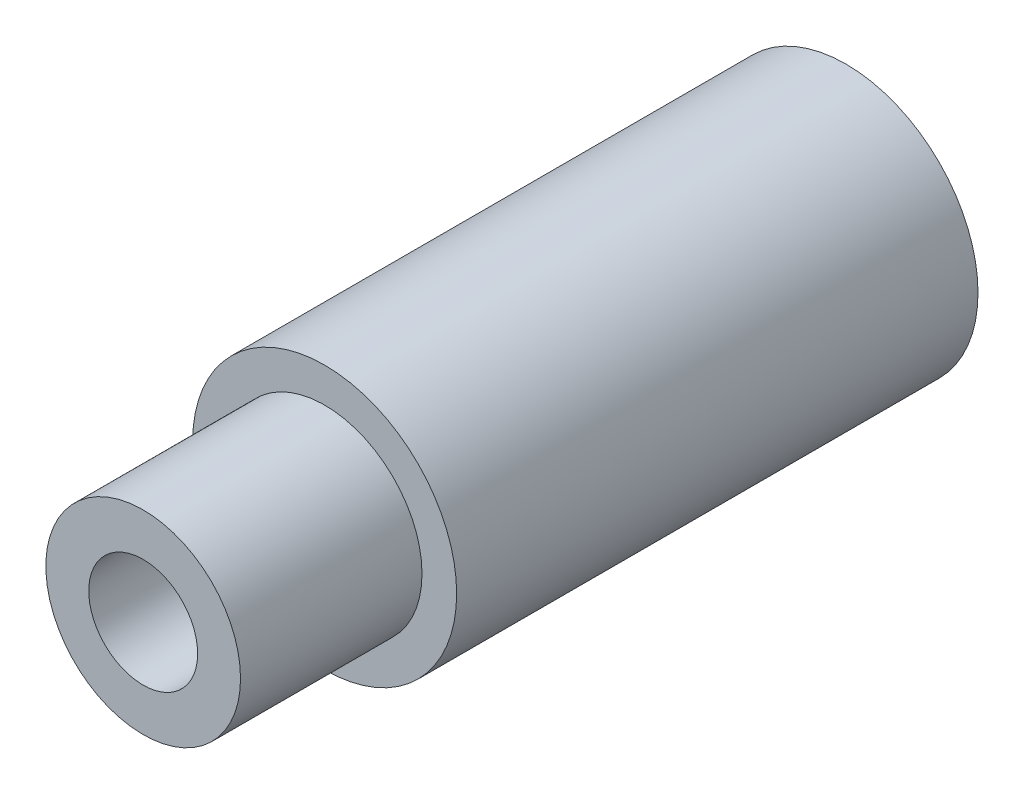
ISO-10303-21;
HEADER;
FILE_DESCRIPTION(('STEP AP214'),'2;1');
FILE_NAME('part.step','',(''),(''),'','','');
FILE_SCHEMA(('AUTOMOTIVE_DESIGN { 1 0 10303 214 1 1 1 1 }'));
ENDSEC;
DATA;
#1=APPLICATION_CONTEXT('core data for automotive mechanical design processes');
#2=APPLICATION_PROTOCOL_DEFINITION('international standard','automotive_design',2000,#1);
#3=PRODUCT_CONTEXT('',#1,'mechanical');
#4=PRODUCT('Part','Part','',(#3));
#5=PRODUCT_RELATED_PRODUCT_CATEGORY('part','',(#4));
#6=PRODUCT_DEFINITION_FORMATION('','',#4);
#7=PRODUCT_DEFINITION_CONTEXT('part definition',#1,'design');
#8=PRODUCT_DEFINITION('design','',#6,#7);
#9=PRODUCT_DEFINITION_SHAPE('','',#8);
#10=(LENGTH_UNIT() NAMED_UNIT(*) SI_UNIT(.MILLI.,.METRE.));
#11=(NAMED_UNIT(*) PLANE_ANGLE_UNIT() SI_UNIT($,.RADIAN.));
#12=(NAMED_UNIT(*) SI_UNIT($,.STERADIAN.) SOLID_ANGLE_UNIT());
#13=UNCERTAINTY_MEASURE_WITH_UNIT(LENGTH_MEASURE(1.E-05),#10,'distance_accuracy_value','');
#14=(GEOMETRIC_REPRESENTATION_CONTEXT(3) GLOBAL_UNCERTAINTY_ASSIGNED_CONTEXT((#13)) GLOBAL_UNIT_ASSIGNED_CONTEXT((#10,
#11,#12)) REPRESENTATION_CONTEXT('',''));
#15=CARTESIAN_POINT('',(0.,0.,0.));
#16=DIRECTION('',(0.,0.,1.));
#17=DIRECTION('',(1.,0.,0.));
#18=AXIS2_PLACEMENT_3D('',#15,#16,#17);
#19=CARTESIAN_POINT('',(0.,0.,7.9));
#20=DIRECTION('',(0.,0.,-1.));
#21=DIRECTION('',(-1.,0.,0.));
#22=AXIS2_PLACEMENT_3D('',#19,#20,#21);
#23=CYLINDRICAL_SURFACE('',#22,4.);
#24=CARTESIAN_POINT('',(0.,0.,7.9));
#25=DIRECTION('',(0.,0.,1.));
#26=DIRECTION('',(1.,0.,0.));
#27=AXIS2_PLACEMENT_3D('',#24,#25,#26);
#28=CIRCLE('',#27,4.);
#29=CARTESIAN_POINT('',(4.,0.,7.9));
#30=VERTEX_POINT('',#29);
#31=EDGE_CURVE('E45',#30,#30,#28,.T.);
#32=ORIENTED_EDGE('',*,*,#31,.F.);
#33=EDGE_LOOP('',(#32));
#34=FACE_BOUND('',#33,.T.);
#35=CARTESIAN_POINT('',(0.,0.,-7.9));
#36=DIRECTION('',(0.,0.,1.));
#37=DIRECTION('',(1.,0.,0.));
#38=AXIS2_PLACEMENT_3D('',#35,#36,#37);
#39=CIRCLE('',#38,4.);
#40=CARTESIAN_POINT('',(4.,0.,-7.9));
#41=VERTEX_POINT('',#40);
#42=EDGE_CURVE('E40',#41,#41,#39,.T.);
#43=ORIENTED_EDGE('',*,*,#42,.T.);
#44=EDGE_LOOP('',(#43));
#45=FACE_BOUND('',#44,.T.);
#46=ADVANCED_FACE('F37',(#34,#45),#23,.T.);
#47=CARTESIAN_POINT('',(0.,0.,7.9));
#48=DIRECTION('',(0.,0.,1.));
#49=DIRECTION('',(1.,0.,0.));
#50=AXIS2_PLACEMENT_3D('',#47,#48,#49);
#51=PLANE('',#50);
#52=CARTESIAN_POINT('',(0.,0.,7.9));
#53=DIRECTION('',(0.,0.,1.));
#54=DIRECTION('',(1.,0.,0.));
#55=AXIS2_PLACEMENT_3D('',#52,#53,#54);
#56=CIRCLE('',#55,2.95);
#57=CARTESIAN_POINT('',(2.95,0.,7.9));
#58=VERTEX_POINT('',#57);
#59=EDGE_CURVE('E11',#58,#58,#56,.T.);
#60=ORIENTED_EDGE('',*,*,#59,.F.);
#61=EDGE_LOOP('',(#60));
#62=FACE_BOUND('',#61,.T.);
#63=ORIENTED_EDGE('',*,*,#31,.T.);
#64=EDGE_LOOP('',(#63));
#65=FACE_BOUND('',#64,.T.);
#66=ADVANCED_FACE('F85',(#62,#65),#51,.T.);
#67=CARTESIAN_POINT('',(0.,0.,-7.9));
#68=DIRECTION('',(0.,0.,1.));
#69=DIRECTION('',(1.,0.,0.));
#70=AXIS2_PLACEMENT_3D('',#67,#68,#69);
#71=PLANE('',#70);
#72=CARTESIAN_POINT('',(0.,0.,-7.9));
#73=DIRECTION('',(0.,0.,-1.));
#74=DIRECTION('',(-1.,0.,0.));
#75=AXIS2_PLACEMENT_3D('',#72,#73,#74);
#76=CIRCLE('',#75,1.64999999999999);
#77=CARTESIAN_POINT('',(-1.64999999999999,0.,-7.9));
#78=VERTEX_POINT('',#77);
#79=EDGE_CURVE('E63',#78,#78,#76,.T.);
#80=ORIENTED_EDGE('',*,*,#79,.F.);
#81=EDGE_LOOP('',(#80));
#82=FACE_BOUND('',#81,.T.);
#83=ORIENTED_EDGE('',*,*,#42,.F.);
#84=EDGE_LOOP('',(#83));
#85=FACE_BOUND('',#84,.T.);
#86=ADVANCED_FACE('F82',(#82,#85),#71,.F.);
#87=CARTESIAN_POINT('',(0.,0.,13.4));
#88=DIRECTION('',(0.,0.,-1.));
#89=DIRECTION('',(-1.,0.,0.));
#90=AXIS2_PLACEMENT_3D('',#87,#88,#89);
#91=CYLINDRICAL_SURFACE('',#90,2.95);
#92=CARTESIAN_POINT('',(0.,0.,13.4));
#93=DIRECTION('',(0.,0.,1.));
#94=DIRECTION('',(1.,0.,0.));
#95=AXIS2_PLACEMENT_3D('',#92,#93,#94);
#96=CIRCLE('',#95,2.95);
#97=CARTESIAN_POINT('',(2.95,0.,13.4));
#98=VERTEX_POINT('',#97);
#99=EDGE_CURVE('E73',#98,#98,#96,.T.);
#100=ORIENTED_EDGE('',*,*,#99,.F.);
#101=EDGE_LOOP('',(#100));
#102=FACE_BOUND('',#101,.T.);
#103=ORIENTED_EDGE('',*,*,#59,.T.);
#104=EDGE_LOOP('',(#103));
#105=FACE_BOUND('',#104,.T.);
#106=ADVANCED_FACE('F84',(#102,#105),#91,.T.);
#107=CARTESIAN_POINT('',(0.,0.,13.4));
#108=DIRECTION('',(0.,0.,1.));
#109=DIRECTION('',(1.,0.,0.));
#110=AXIS2_PLACEMENT_3D('',#107,#108,#109);
#111=PLANE('',#110);
#112=CARTESIAN_POINT('',(0.,0.,13.4));
#113=DIRECTION('',(0.,0.,1.));
#114=DIRECTION('',(1.,0.,0.));
#115=AXIS2_PLACEMENT_3D('',#112,#113,#114);
#116=CIRCLE('',#115,1.64999999999999);
#117=CARTESIAN_POINT('',(1.64999999999999,0.,13.4));
#118=VERTEX_POINT('',#117);
#119=EDGE_CURVE('E62',#118,#118,#116,.T.);
#120=ORIENTED_EDGE('',*,*,#119,.F.);
#121=EDGE_LOOP('',(#120));
#122=FACE_BOUND('',#121,.T.);
#123=ORIENTED_EDGE('',*,*,#99,.T.);
#124=EDGE_LOOP('',(#123));
#125=FACE_BOUND('',#124,.T.);
#126=ADVANCED_FACE('F91',(#122,#125),#111,.T.);
#127=CARTESIAN_POINT('',(0.,0.,6.4));
#128=DIRECTION('',(0.,0.,1.));
#129=DIRECTION('',(1.,0.,0.));
#130=AXIS2_PLACEMENT_3D('',#127,#128,#129);
#131=CONICAL_SURFACE('',#130,1.65,1.02974425867665);
#132=CARTESIAN_POINT('',(0.,0.,5.40857997860453));
#133=VERTEX_POINT('',#132);
#134=VERTEX_LOOP('',#133);
#135=FACE_BOUND('',#134,.T.);
#136=CARTESIAN_POINT('',(0.,0.,6.4));
#137=DIRECTION('',(0.,0.,1.));
#138=DIRECTION('',(1.,0.,0.));
#139=AXIS2_PLACEMENT_3D('',#136,#137,#138);
#140=CIRCLE('',#139,1.65);
#141=CARTESIAN_POINT('',(1.65,0.,6.4));
#142=VERTEX_POINT('',#141);
#143=EDGE_CURVE('E66',#142,#142,#140,.T.);
#144=ORIENTED_EDGE('',*,*,#143,.T.);
#145=EDGE_LOOP('',(#144));
#146=FACE_BOUND('',#145,.T.);
#147=ADVANCED_FACE('F124',(#135,#146),#131,.F.);
#148=CARTESIAN_POINT('',(0.,0.,13.4));
#149=DIRECTION('',(0.,0.,1.));
#150=DIRECTION('',(1.,0.,0.));
#151=AXIS2_PLACEMENT_3D('',#148,#149,#150);
#152=CYLINDRICAL_SURFACE('',#151,1.64999999999999);
#153=ORIENTED_EDGE('',*,*,#143,.F.);
#154=EDGE_LOOP('',(#153));
#155=FACE_BOUND('',#154,.T.);
#156=ORIENTED_EDGE('',*,*,#119,.T.);
#157=EDGE_LOOP('',(#156));
#158=FACE_BOUND('',#157,.T.);
#159=ADVANCED_FACE('F56',(#155,#158),#152,.F.);
#160=CARTESIAN_POINT('',(0.,0.,-0.900000000000001));
#161=DIRECTION('',(0.,0.,-1.));
#162=DIRECTION('',(-1.,0.,0.));
#163=AXIS2_PLACEMENT_3D('',#160,#161,#162);
#164=CONICAL_SURFACE('',#163,1.65,1.02974425867665);
#165=CARTESIAN_POINT('',(0.,0.,0.0914200213954722));
#166=VERTEX_POINT('',#165);
#167=VERTEX_LOOP('',#166);
#168=FACE_BOUND('',#167,.T.);
#169=CARTESIAN_POINT('',(0.,0.,-0.900000000000001));
#170=DIRECTION('',(0.,0.,-1.));
#171=DIRECTION('',(-1.,0.,0.));
#172=AXIS2_PLACEMENT_3D('',#169,#170,#171);
#173=CIRCLE('',#172,1.65);
#174=CARTESIAN_POINT('',(-1.65,0.,-0.900000000000001));
#175=VERTEX_POINT('',#174);
#176=EDGE_CURVE('E60',#175,#175,#173,.T.);
#177=ORIENTED_EDGE('',*,*,#176,.T.);
#178=EDGE_LOOP('',(#177));
#179=FACE_BOUND('',#178,.T.);
#180=ADVANCED_FACE('F52',(#168,#179),#164,.F.);
#181=CARTESIAN_POINT('',(0.,0.,-7.9));
#182=DIRECTION('',(0.,0.,-1.));
#183=DIRECTION('',(-1.,0.,0.));
#184=AXIS2_PLACEMENT_3D('',#181,#182,#183);
#185=CYLINDRICAL_SURFACE('',#184,1.64999999999999);
#186=ORIENTED_EDGE('',*,*,#176,.F.);
#187=EDGE_LOOP('',(#186));
#188=FACE_BOUND('',#187,.T.);
#189=ORIENTED_EDGE('',*,*,#79,.T.);
#190=EDGE_LOOP('',(#189));
#191=FACE_BOUND('',#190,.T.);
#192=ADVANCED_FACE('F55',(#188,#191),#185,.F.);
#193=CLOSED_SHELL('',(#46,#66,#86,#106,#126,#147,#159,#180,#192));
#194=MANIFOLD_SOLID_BREP('B2',#193);
#195=ADVANCED_BREP_SHAPE_REPRESENTATION('',(#18,#194),#14);
#196=SHAPE_DEFINITION_REPRESENTATION(#9,#195);
ENDSEC;
END-ISO-10303-21;
